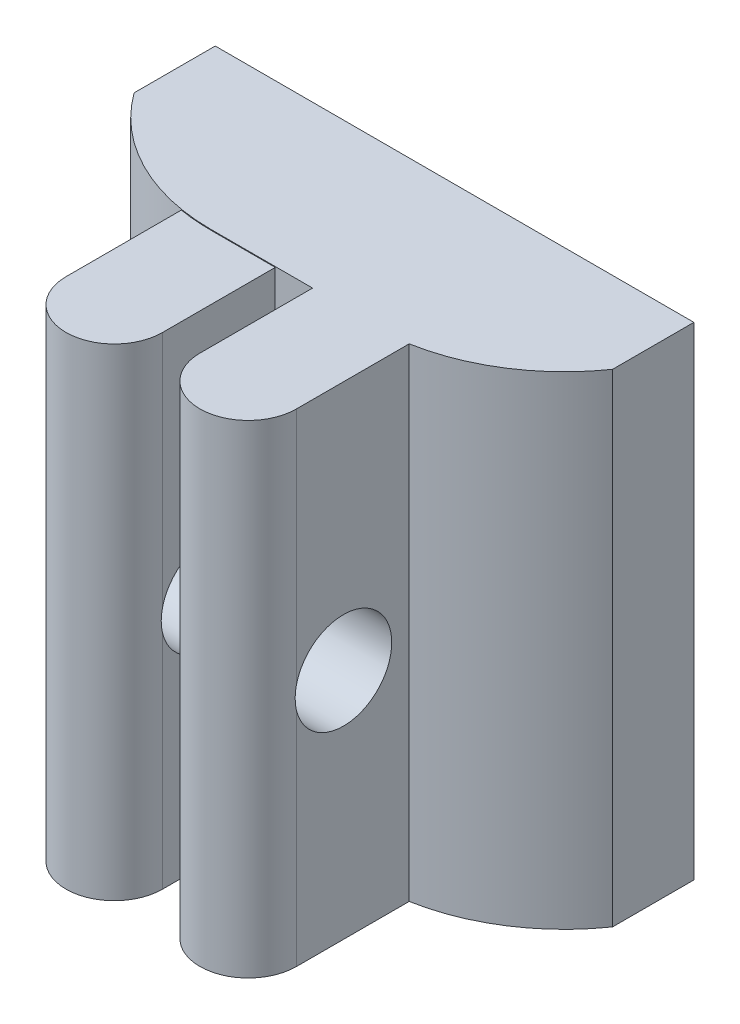
ISO-10303-21;
HEADER;
FILE_DESCRIPTION(('STEP AP214'),'2;1');
FILE_NAME('part.step','',(''),(''),'','','');
FILE_SCHEMA(('AUTOMOTIVE_DESIGN { 1 0 10303 214 1 1 1 1 }'));
ENDSEC;
DATA;
#1=APPLICATION_CONTEXT('core data for automotive mechanical design processes');
#2=APPLICATION_PROTOCOL_DEFINITION('international standard','automotive_design',2000,#1);
#3=PRODUCT_CONTEXT('',#1,'mechanical');
#4=PRODUCT('Part','Part','',(#3));
#5=PRODUCT_RELATED_PRODUCT_CATEGORY('part','',(#4));
#6=PRODUCT_DEFINITION_FORMATION('','',#4);
#7=PRODUCT_DEFINITION_CONTEXT('part definition',#1,'design');
#8=PRODUCT_DEFINITION('design','',#6,#7);
#9=PRODUCT_DEFINITION_SHAPE('','',#8);
#10=(LENGTH_UNIT() NAMED_UNIT(*) SI_UNIT(.MILLI.,.METRE.));
#11=(NAMED_UNIT(*) PLANE_ANGLE_UNIT() SI_UNIT($,.RADIAN.));
#12=(NAMED_UNIT(*) SI_UNIT($,.STERADIAN.) SOLID_ANGLE_UNIT());
#13=UNCERTAINTY_MEASURE_WITH_UNIT(LENGTH_MEASURE(1.E-05),#10,'distance_accuracy_value','');
#14=(GEOMETRIC_REPRESENTATION_CONTEXT(3) GLOBAL_UNCERTAINTY_ASSIGNED_CONTEXT((#13)) GLOBAL_UNIT_ASSIGNED_CONTEXT((#10,
#11,#12)) REPRESENTATION_CONTEXT('',''));
#15=CARTESIAN_POINT('',(0.,0.,0.));
#16=DIRECTION('',(0.,0.,1.));
#17=DIRECTION('',(1.,0.,0.));
#18=AXIS2_PLACEMENT_3D('',#15,#16,#17);
#19=CARTESIAN_POINT('',(0.,0.,5.));
#20=DIRECTION('',(0.,-1.,0.));
#21=DIRECTION('',(1.,0.,0.));
#22=AXIS2_PLACEMENT_3D('',#19,#20,#21);
#23=PLANE('',#22);
#24=DIRECTION('',(0.,0.,-1.));
#25=VECTOR('',#24,1.);
#26=CARTESIAN_POINT('',(-1.07615494269157,0.,10.));
#27=LINE('',#26,#25);
#28=CARTESIAN_POINT('',(-1.07615494269157,0.,2.52666623854685));
#29=VERTEX_POINT('',#28);
#30=CARTESIAN_POINT('',(-1.07615494269157,0.,0.));
#31=VERTEX_POINT('',#30);
#32=EDGE_CURVE('E56',#29,#31,#27,.T.);
#33=ORIENTED_EDGE('',*,*,#32,.T.);
#34=DIRECTION('',(-1.,0.,0.));
#35=VECTOR('',#34,1.);
#36=CARTESIAN_POINT('',(0.,0.,0.));
#37=LINE('',#36,#35);
#38=CARTESIAN_POINT('',(-15.9435867013809,0.,0.));
#39=VERTEX_POINT('',#38);
#40=EDGE_CURVE('E171',#31,#39,#37,.T.);
#41=ORIENTED_EDGE('',*,*,#40,.T.);
#42=DIRECTION('',(0.,0.,-1.));
#43=VECTOR('',#42,1.);
#44=CARTESIAN_POINT('',(-15.9435867013809,0.,10.));
#45=LINE('',#44,#43);
#46=CARTESIAN_POINT('',(-15.9435867013809,0.,2.51903987752583));
#47=VERTEX_POINT('',#46);
#48=EDGE_CURVE('E334',#47,#39,#45,.T.);
#49=ORIENTED_EDGE('',*,*,#48,.F.);
#50=CARTESIAN_POINT('',(-11.0839202169004,0.,-1.));
#51=DIRECTION('',(0.,-1.,0.));
#52=DIRECTION('',(1.,0.,0.));
#53=AXIS2_PLACEMENT_3D('',#50,#51,#52);
#54=CIRCLE('',#53,6.);
#55=CARTESIAN_POINT('',(-11.0839202169004,0.,5.));
#56=VERTEX_POINT('',#55);
#57=EDGE_CURVE('E192',#47,#56,#54,.F.);
#58=ORIENTED_EDGE('',*,*,#57,.T.);
#59=DIRECTION('',(-1.,0.,0.));
#60=VECTOR('',#59,1.);
#61=CARTESIAN_POINT('',(0.,0.,5.));
#62=LINE('',#61,#60);
#63=CARTESIAN_POINT('',(-7.92,0.,5.));
#64=VERTEX_POINT('',#63);
#65=EDGE_CURVE('E181',#64,#56,#62,.T.);
#66=ORIENTED_EDGE('',*,*,#65,.F.);
#67=DIRECTION('',(0.,0.,-1.));
#68=VECTOR('',#67,1.);
#69=CARTESIAN_POINT('',(-7.92,0.,10.));
#70=LINE('',#69,#68);
#71=CARTESIAN_POINT('',(-7.92,0.,8.5));
#72=VERTEX_POINT('',#71);
#73=EDGE_CURVE('E317',#72,#64,#70,.T.);
#74=ORIENTED_EDGE('',*,*,#73,.F.);
#75=CARTESIAN_POINT('',(-6.42,0.,8.5));
#76=DIRECTION('',(0.,-1.,0.));
#77=DIRECTION('',(1.,0.,0.));
#78=AXIS2_PLACEMENT_3D('',#75,#76,#77);
#79=CIRCLE('',#78,1.5);
#80=CARTESIAN_POINT('',(-4.92,0.,8.5));
#81=VERTEX_POINT('',#80);
#82=EDGE_CURVE('E271',#72,#81,#79,.F.);
#83=ORIENTED_EDGE('',*,*,#82,.T.);
#84=DIRECTION('',(0.,0.,-1.));
#85=VECTOR('',#84,1.);
#86=CARTESIAN_POINT('',(-4.92,0.,10.));
#87=LINE('',#86,#85);
#88=CARTESIAN_POINT('',(-4.92,0.,5.));
#89=VERTEX_POINT('',#88);
#90=EDGE_CURVE('E319',#81,#89,#87,.T.);
#91=ORIENTED_EDGE('',*,*,#90,.T.);
#92=CARTESIAN_POINT('',(-6.,0.,-0.90199966113181));
#93=DIRECTION('',(0.,-1.,0.));
#94=DIRECTION('',(1.,0.,0.));
#95=AXIS2_PLACEMENT_3D('',#92,#93,#94);
#96=CIRCLE('',#95,6.);
#97=EDGE_CURVE('E173',#89,#29,#96,.F.);
#98=ORIENTED_EDGE('',*,*,#97,.T.);
#99=EDGE_LOOP('',(#33,#41,#49,#58,#66,#74,#83,#91,#98));
#100=FACE_BOUND('',#99,.T.);
#101=ADVANCED_FACE('F39',(#100),#23,.F.);
#102=CARTESIAN_POINT('',(0.,-15.,5.));
#103=DIRECTION('',(0.,1.,0.));
#104=DIRECTION('',(-1.,0.,0.));
#105=AXIS2_PLACEMENT_3D('',#102,#103,#104);
#106=PLANE('',#105);
#107=DIRECTION('',(0.,0.,-1.));
#108=VECTOR('',#107,1.);
#109=CARTESIAN_POINT('',(-1.07615494269157,-15.,10.));
#110=LINE('',#109,#108);
#111=CARTESIAN_POINT('',(-1.07615494269157,-15.,2.52666623854686));
#112=VERTEX_POINT('',#111);
#113=CARTESIAN_POINT('',(-1.07615494269157,-15.,0.));
#114=VERTEX_POINT('',#113);
#115=EDGE_CURVE('E160',#112,#114,#110,.T.);
#116=ORIENTED_EDGE('',*,*,#115,.F.);
#117=CARTESIAN_POINT('',(-6.,-15.,-0.90199966113181));
#118=DIRECTION('',(0.,1.,0.));
#119=DIRECTION('',(-1.,0.,0.));
#120=AXIS2_PLACEMENT_3D('',#117,#118,#119);
#121=CIRCLE('',#120,6.);
#122=CARTESIAN_POINT('',(-4.92,-15.,5.));
#123=VERTEX_POINT('',#122);
#124=EDGE_CURVE('E198',#112,#123,#121,.F.);
#125=ORIENTED_EDGE('',*,*,#124,.T.);
#126=DIRECTION('',(0.,0.,-1.));
#127=VECTOR('',#126,1.);
#128=CARTESIAN_POINT('',(-4.92,-15.,10.));
#129=LINE('',#128,#127);
#130=CARTESIAN_POINT('',(-4.92,-15.,8.5));
#131=VERTEX_POINT('',#130);
#132=EDGE_CURVE('E183',#131,#123,#129,.T.);
#133=ORIENTED_EDGE('',*,*,#132,.F.);
#134=CARTESIAN_POINT('',(-6.42,-15.,8.5));
#135=DIRECTION('',(0.,1.,0.));
#136=DIRECTION('',(-1.,0.,0.));
#137=AXIS2_PLACEMENT_3D('',#134,#135,#136);
#138=CIRCLE('',#137,1.5);
#139=CARTESIAN_POINT('',(-7.92,-15.,8.5));
#140=VERTEX_POINT('',#139);
#141=EDGE_CURVE('E269',#131,#140,#138,.F.);
#142=ORIENTED_EDGE('',*,*,#141,.T.);
#143=DIRECTION('',(0.,0.,-1.));
#144=VECTOR('',#143,1.);
#145=CARTESIAN_POINT('',(-7.92,-15.,10.));
#146=LINE('',#145,#144);
#147=CARTESIAN_POINT('',(-7.92,-15.,5.));
#148=VERTEX_POINT('',#147);
#149=EDGE_CURVE('E179',#140,#148,#146,.T.);
#150=ORIENTED_EDGE('',*,*,#149,.T.);
#151=DIRECTION('',(1.,0.,0.));
#152=VECTOR('',#151,1.);
#153=CARTESIAN_POINT('',(0.,-15.,5.));
#154=LINE('',#153,#152);
#155=CARTESIAN_POINT('',(-9.08,-15.,5.));
#156=VERTEX_POINT('',#155);
#157=EDGE_CURVE('E186',#156,#148,#154,.T.);
#158=ORIENTED_EDGE('',*,*,#157,.F.);
#159=DIRECTION('',(0.,0.,-1.));
#160=VECTOR('',#159,1.);
#161=CARTESIAN_POINT('',(-9.08,-15.,10.));
#162=LINE('',#161,#160);
#163=CARTESIAN_POINT('',(-9.08,-15.,8.5));
#164=VERTEX_POINT('',#163);
#165=EDGE_CURVE('E286',#164,#156,#162,.T.);
#166=ORIENTED_EDGE('',*,*,#165,.F.);
#167=CARTESIAN_POINT('',(-10.58,-15.,8.5));
#168=DIRECTION('',(0.,1.,0.));
#169=DIRECTION('',(-1.,0.,0.));
#170=AXIS2_PLACEMENT_3D('',#167,#168,#169);
#171=CIRCLE('',#170,1.5);
#172=CARTESIAN_POINT('',(-12.08,-15.,8.5));
#173=VERTEX_POINT('',#172);
#174=EDGE_CURVE('E283',#164,#173,#171,.F.);
#175=ORIENTED_EDGE('',*,*,#174,.T.);
#176=DIRECTION('',(0.,0.,-1.));
#177=VECTOR('',#176,1.);
#178=CARTESIAN_POINT('',(-12.08,-15.,10.));
#179=LINE('',#178,#177);
#180=CARTESIAN_POINT('',(-12.08,-15.,4.91674108489633));
#181=VERTEX_POINT('',#180);
#182=EDGE_CURVE('E281',#173,#181,#179,.T.);
#183=ORIENTED_EDGE('',*,*,#182,.T.);
#184=CARTESIAN_POINT('',(-11.0839202169004,-15.,-1.));
#185=DIRECTION('',(0.,1.,0.));
#186=DIRECTION('',(-1.,0.,0.));
#187=AXIS2_PLACEMENT_3D('',#184,#185,#186);
#188=CIRCLE('',#187,6.);
#189=CARTESIAN_POINT('',(-15.9435867013809,-15.,2.51903987752583));
#190=VERTEX_POINT('',#189);
#191=EDGE_CURVE('E195',#181,#190,#188,.F.);
#192=ORIENTED_EDGE('',*,*,#191,.T.);
#193=DIRECTION('',(0.,0.,-1.));
#194=VECTOR('',#193,1.);
#195=CARTESIAN_POINT('',(-15.9435867013809,-15.,10.));
#196=LINE('',#195,#194);
#197=CARTESIAN_POINT('',(-15.9435867013809,-15.,0.));
#198=VERTEX_POINT('',#197);
#199=EDGE_CURVE('E63',#190,#198,#196,.T.);
#200=ORIENTED_EDGE('',*,*,#199,.T.);
#201=DIRECTION('',(1.,0.,0.));
#202=VECTOR('',#201,1.);
#203=CARTESIAN_POINT('',(0.,-15.,0.));
#204=LINE('',#203,#202);
#205=EDGE_CURVE('E178',#198,#114,#204,.T.);
#206=ORIENTED_EDGE('',*,*,#205,.T.);
#207=EDGE_LOOP('',(#116,#125,#133,#142,#150,#158,#166,#175,#183,#192,#200,#206));
#208=FACE_BOUND('',#207,.T.);
#209=ADVANCED_FACE('F279',(#208),#106,.F.);
#210=CARTESIAN_POINT('',(0.,0.,0.));
#211=DIRECTION('',(0.,0.,-1.));
#212=DIRECTION('',(-1.,0.,0.));
#213=AXIS2_PLACEMENT_3D('',#210,#211,#212);
#214=PLANE('',#213);
#215=ORIENTED_EDGE('',*,*,#40,.F.);
#216=DIRECTION('',(0.,-1.,0.));
#217=VECTOR('',#216,1.);
#218=CARTESIAN_POINT('',(-1.07615494269157,0.,0.));
#219=LINE('',#218,#217);
#220=EDGE_CURVE('E157',#31,#114,#219,.T.);
#221=ORIENTED_EDGE('',*,*,#220,.T.);
#222=ORIENTED_EDGE('',*,*,#205,.F.);
#223=DIRECTION('',(0.,1.,0.));
#224=VECTOR('',#223,1.);
#225=CARTESIAN_POINT('',(-15.9435867013809,0.,0.));
#226=LINE('',#225,#224);
#227=EDGE_CURVE('E165',#198,#39,#226,.T.);
#228=ORIENTED_EDGE('',*,*,#227,.T.);
#229=EDGE_LOOP('',(#215,#221,#222,#228));
#230=FACE_BOUND('',#229,.T.);
#231=ADVANCED_FACE('F177',(#230),#214,.T.);
#232=CARTESIAN_POINT('',(-6.,0.,-0.90199966113181));
#233=DIRECTION('',(0.,1.,0.));
#234=DIRECTION('',(-1.,0.,0.));
#235=AXIS2_PLACEMENT_3D('',#232,#233,#234);
#236=CYLINDRICAL_SURFACE('',#235,6.);
#237=ORIENTED_EDGE('',*,*,#124,.F.);
#238=DIRECTION('',(0.,1.,0.));
#239=VECTOR('',#238,1.);
#240=CARTESIAN_POINT('',(-1.07615494269157,0.,2.52666623854686));
#241=LINE('',#240,#239);
#242=EDGE_CURVE('E11',#112,#29,#241,.T.);
#243=ORIENTED_EDGE('',*,*,#242,.T.);
#244=ORIENTED_EDGE('',*,*,#97,.F.);
#245=DIRECTION('',(0.,1.,0.));
#246=VECTOR('',#245,1.);
#247=CARTESIAN_POINT('',(-4.92,0.,5.));
#248=LINE('',#247,#246);
#249=EDGE_CURVE('E314',#123,#89,#248,.T.);
#250=ORIENTED_EDGE('',*,*,#249,.F.);
#251=EDGE_LOOP('',(#237,#243,#244,#250));
#252=FACE_BOUND('',#251,.T.);
#253=ADVANCED_FACE('F369',(#252),#236,.T.);
#254=CARTESIAN_POINT('',(-11.0839202169004,0.,-1.));
#255=DIRECTION('',(0.,1.,0.));
#256=DIRECTION('',(0.,0.,1.));
#257=AXIS2_PLACEMENT_3D('',#254,#255,#256);
#258=CYLINDRICAL_SURFACE('',#257,6.);
#259=ORIENTED_EDGE('',*,*,#57,.F.);
#260=DIRECTION('',(0.,1.,0.));
#261=VECTOR('',#260,1.);
#262=CARTESIAN_POINT('',(-15.9435867013809,0.,2.51903987752583));
#263=LINE('',#262,#261);
#264=EDGE_CURVE('E49',#47,#190,#263,.F.);
#265=ORIENTED_EDGE('',*,*,#264,.T.);
#266=ORIENTED_EDGE('',*,*,#191,.F.);
#267=DIRECTION('',(0.,1.,0.));
#268=VECTOR('',#267,1.);
#269=CARTESIAN_POINT('',(-12.08,-0.0236385703848998,4.91674108489633));
#270=LINE('',#269,#268);
#271=CARTESIAN_POINT('',(-12.08,-0.0236385703848998,4.91674108489633));
#272=VERTEX_POINT('',#271);
#273=EDGE_CURVE('E206',#272,#181,#270,.F.);
#274=ORIENTED_EDGE('',*,*,#273,.F.);
#275=CARTESIAN_POINT('',(-11.0839202169004,-0.0236385703848998,-1.));
#276=DIRECTION('',(0.,-1.,0.));
#277=DIRECTION('',(1.,0.,0.));
#278=AXIS2_PLACEMENT_3D('',#275,#276,#277);
#279=CIRCLE('',#278,6.);
#280=CARTESIAN_POINT('',(-11.0839202169004,-0.0236385703848998,5.));
#281=VERTEX_POINT('',#280);
#282=EDGE_CURVE('E203',#281,#272,#279,.T.);
#283=ORIENTED_EDGE('',*,*,#282,.F.);
#284=DIRECTION('',(0.,1.,0.));
#285=VECTOR('',#284,1.);
#286=CARTESIAN_POINT('',(-11.0839202169004,0.,5.));
#287=LINE('',#286,#285);
#288=EDGE_CURVE('E200',#56,#281,#287,.F.);
#289=ORIENTED_EDGE('',*,*,#288,.F.);
#290=EDGE_LOOP('',(#259,#265,#266,#274,#283,#289));
#291=FACE_BOUND('',#290,.T.);
#292=ADVANCED_FACE('F275',(#291),#258,.T.);
#293=CARTESIAN_POINT('',(-6.42,-15.,8.5));
#294=DIRECTION('',(0.,-1.,0.));
#295=DIRECTION('',(1.,0.,0.));
#296=AXIS2_PLACEMENT_3D('',#293,#294,#295);
#297=CYLINDRICAL_SURFACE('',#296,1.5);
#298=DIRECTION('',(0.,1.,0.));
#299=VECTOR('',#298,1.);
#300=CARTESIAN_POINT('',(-7.92,-15.,8.5));
#301=LINE('',#300,#299);
#302=CARTESIAN_POINT('',(-7.92,-8.11241498930769,8.5));
#303=VERTEX_POINT('',#302);
#304=EDGE_CURVE('E257',#140,#303,#301,.T.);
#305=ORIENTED_EDGE('',*,*,#304,.F.);
#306=ORIENTED_EDGE('',*,*,#141,.F.);
#307=DIRECTION('',(0.,1.,0.));
#308=VECTOR('',#307,1.);
#309=CARTESIAN_POINT('',(-4.92,-15.,8.5));
#310=LINE('',#309,#308);
#311=CARTESIAN_POINT('',(-4.92,-8.11241498930769,8.5));
#312=VERTEX_POINT('',#311);
#313=EDGE_CURVE('E264',#312,#131,#310,.F.);
#314=ORIENTED_EDGE('',*,*,#313,.F.);
#315=CARTESIAN_POINT('',(-4.92,-7.41254560298488,8.5));
#316=CARTESIAN_POINT('',(-4.92001371546828,-7.45412724418204,8.50998083315785));
#317=CARTESIAN_POINT('',(-4.9201002060891,-7.49613741775952,8.51817415680516));
#318=CARTESIAN_POINT('',(-4.9203019560262,-7.58070019302562,8.53094623275822));
#319=CARTESIAN_POINT('',(-4.92041721297341,-7.6232527497722,8.53552528259058));
#320=CARTESIAN_POINT('',(-4.92055778771822,-7.70741499094998,8.54095494207867));
#321=CARTESIAN_POINT('',(-4.92058549988733,-7.74901828635982,8.54190496227109));
#322=CARTESIAN_POINT('',(-4.92054226277862,-7.83215876470274,8.54034650872186));
#323=CARTESIAN_POINT('',(-4.9204713169154,-7.8736959498741,8.53783815467585));
#324=CARTESIAN_POINT('',(-4.92028181879158,-7.95642005855864,8.52937975231243));
#325=CARTESIAN_POINT('',(-4.92016326453282,-7.99760696729637,8.52342955953406));
#326=CARTESIAN_POINT('',(-4.92000273049526,-8.07934507147401,8.50812900417141));
#327=CARTESIAN_POINT('',(-4.91996075234869,-8.11989625334496,8.49877856911518));
#328=CARTESIAN_POINT('',(-4.92014167531044,-8.20122206947848,8.47642670475488));
#329=CARTESIAN_POINT('',(-4.92037213747244,-8.24197030682407,8.46332907491474));
#330=CARTESIAN_POINT('',(-4.9213953460393,-8.322200778971,8.43370599562309));
#331=CARTESIAN_POINT('',(-4.92218818592813,-8.36168280214909,8.4171799765941));
#332=CARTESIAN_POINT('',(-4.92340465615959,-8.40037620756465,8.39899318441214));
#333=B_SPLINE_CURVE_WITH_KNOTS('',3,(#315,#316,#317,#318,#319,#320,#321,#322,#323,#324,#325,
#326,#327,#328,#329,#330,#331,#332),.UNSPECIFIED.,.F.,.F.,(4,2,2,2,2,2,2,2,4),(0.,
0.128248812008016,0.256487065486652,0.381186174696836,0.505880968132207,0.630580995641019,
0.755283681131896,0.883530080847569,1.01179780394237),.UNSPECIFIED.);
#334=CARTESIAN_POINT('',(-4.92,-7.41254560298488,8.5));
#335=VERTEX_POINT('',#334);
#336=EDGE_CURVE('E249',#335,#312,#333,.T.);
#337=ORIENTED_EDGE('',*,*,#336,.F.);
#338=DIRECTION('',(0.,1.,0.));
#339=VECTOR('',#338,1.);
#340=CARTESIAN_POINT('',(-4.92,-15.,8.5));
#341=LINE('',#340,#339);
#342=EDGE_CURVE('E267',#81,#335,#341,.F.);
#343=ORIENTED_EDGE('',*,*,#342,.F.);
#344=ORIENTED_EDGE('',*,*,#82,.F.);
#345=DIRECTION('',(0.,1.,0.));
#346=VECTOR('',#345,1.);
#347=CARTESIAN_POINT('',(-7.92,-15.,8.5));
#348=LINE('',#347,#346);
#349=CARTESIAN_POINT('',(-7.92,-7.41254560298488,8.5));
#350=VERTEX_POINT('',#349);
#351=EDGE_CURVE('E332',#350,#72,#348,.T.);
#352=ORIENTED_EDGE('',*,*,#351,.F.);
#353=CARTESIAN_POINT('',(-7.92,-8.11241498930769,8.5));
#354=CARTESIAN_POINT('',(-7.91998628453172,-8.07083334811054,8.50998083315785));
#355=CARTESIAN_POINT('',(-7.9198997939109,-8.02882317453306,8.51817415680516));
#356=CARTESIAN_POINT('',(-7.9196980439738,-7.94426039926696,8.53094623275822));
#357=CARTESIAN_POINT('',(-7.91958278702659,-7.90170784252037,8.53552528259058));
#358=CARTESIAN_POINT('',(-7.91944221228178,-7.8175456013426,8.54095494207867));
#359=CARTESIAN_POINT('',(-7.91941450011267,-7.77594230593276,8.54190496227109));
#360=CARTESIAN_POINT('',(-7.91945773722137,-7.69280182758984,8.54034650872186));
#361=CARTESIAN_POINT('',(-7.9195286830846,-7.65126464241848,8.53783815467585));
#362=CARTESIAN_POINT('',(-7.91971818120842,-7.56854053373394,8.52937975231243));
#363=CARTESIAN_POINT('',(-7.91983673546718,-7.52735362499621,8.52342955953406));
#364=CARTESIAN_POINT('',(-7.91999726950474,-7.44561552081858,8.50812900417141));
#365=CARTESIAN_POINT('',(-7.92003924765131,-7.40506433894762,8.49877856911519));
#366=CARTESIAN_POINT('',(-7.91985832468956,-7.3237385228141,8.47642670475488));
#367=CARTESIAN_POINT('',(-7.91962786252755,-7.28299028546851,8.46332907491475));
#368=CARTESIAN_POINT('',(-7.9186046539607,-7.20275981332158,8.4337059956231));
#369=CARTESIAN_POINT('',(-7.91781181407187,-7.16327779014349,8.41717997659411));
#370=CARTESIAN_POINT('',(-7.91659534384041,-7.12458438472793,8.39899318441214));
#371=B_SPLINE_CURVE_WITH_KNOTS('',3,(#353,#354,#355,#356,#357,#358,#359,#360,#361,#362,#363,
#364,#365,#366,#367,#368,#369,#370),.UNSPECIFIED.,.F.,.F.,(4,2,2,2,2,2,2,2,4),(0.,
0.128248812008016,0.25648706548665,0.381186174696835,0.505880968132204,0.630580995641014,
0.755283681131891,0.883530080847564,1.01179780394237),.UNSPECIFIED.);
#372=EDGE_CURVE('E256',#303,#350,#371,.T.);
#373=ORIENTED_EDGE('',*,*,#372,.F.);
#374=EDGE_LOOP('',(#305,#306,#314,#337,#343,#344,#352,#373));
#375=FACE_BOUND('',#374,.T.);
#376=ADVANCED_FACE('F42',(#375),#297,.T.);
#377=CARTESIAN_POINT('',(-10.58,-15.,8.5));
#378=DIRECTION('',(0.,-1.,0.));
#379=DIRECTION('',(1.,0.,0.));
#380=AXIS2_PLACEMENT_3D('',#377,#378,#379);
#381=CYLINDRICAL_SURFACE('',#380,1.5);
#382=DIRECTION('',(0.,1.,0.));
#383=VECTOR('',#382,1.);
#384=CARTESIAN_POINT('',(-12.08,-15.,8.5));
#385=LINE('',#384,#383);
#386=CARTESIAN_POINT('',(-12.08,-8.11241498930769,8.5));
#387=VERTEX_POINT('',#386);
#388=EDGE_CURVE('E212',#173,#387,#385,.T.);
#389=ORIENTED_EDGE('',*,*,#388,.F.);
#390=ORIENTED_EDGE('',*,*,#174,.F.);
#391=DIRECTION('',(0.,1.,0.));
#392=VECTOR('',#391,1.);
#393=CARTESIAN_POINT('',(-9.08,-15.,8.5));
#394=LINE('',#393,#392);
#395=CARTESIAN_POINT('',(-9.08,-8.11241498930769,8.5));
#396=VERTEX_POINT('',#395);
#397=EDGE_CURVE('E348',#396,#164,#394,.F.);
#398=ORIENTED_EDGE('',*,*,#397,.F.);
#399=CARTESIAN_POINT('',(-9.08,-7.41254560298488,8.5));
#400=CARTESIAN_POINT('',(-9.08001371546828,-7.45412724418204,8.50998083315785));
#401=CARTESIAN_POINT('',(-9.0801002060891,-7.49613741775952,8.51817415680516));
#402=CARTESIAN_POINT('',(-9.0803019560262,-7.58070019302562,8.53094623275822));
#403=CARTESIAN_POINT('',(-9.08041721297341,-7.6232527497722,8.53552528259058));
#404=CARTESIAN_POINT('',(-9.08055778771822,-7.70741499094998,8.54095494207867));
#405=CARTESIAN_POINT('',(-9.08058549988733,-7.74901828635982,8.54190496227109));
#406=CARTESIAN_POINT('',(-9.08054226277862,-7.83215876470274,8.54034650872186));
#407=CARTESIAN_POINT('',(-9.0804713169154,-7.8736959498741,8.53783815467585));
#408=CARTESIAN_POINT('',(-9.08028181879158,-7.95642005855864,8.52937975231243));
#409=CARTESIAN_POINT('',(-9.08016326453282,-7.99760696729637,8.52342955953406));
#410=CARTESIAN_POINT('',(-9.08000273049526,-8.07934507147401,8.50812900417141));
#411=CARTESIAN_POINT('',(-9.07996075234869,-8.11989625334496,8.49877856911518));
#412=CARTESIAN_POINT('',(-9.08014167531044,-8.20122206947848,8.47642670475488));
#413=CARTESIAN_POINT('',(-9.08037213747244,-8.24197030682407,8.46332907491474));
#414=CARTESIAN_POINT('',(-9.0813953460393,-8.322200778971,8.43370599562309));
#415=CARTESIAN_POINT('',(-9.08218818592813,-8.36168280214909,8.4171799765941));
#416=CARTESIAN_POINT('',(-9.08340465615959,-8.40037620756465,8.39899318441214));
#417=B_SPLINE_CURVE_WITH_KNOTS('',3,(#399,#400,#401,#402,#403,#404,#405,#406,#407,#408,#409,
#410,#411,#412,#413,#414,#415,#416),.UNSPECIFIED.,.F.,.F.,(4,2,2,2,2,2,2,2,4),(0.,
0.128248812008016,0.256487065486652,0.381186174696836,0.505880968132207,0.630580995641019,
0.755283681131896,0.883530080847569,1.01179780394237),.UNSPECIFIED.);
#418=CARTESIAN_POINT('',(-9.08,-7.41254560298488,8.5));
#419=VERTEX_POINT('',#418);
#420=EDGE_CURVE('E215',#419,#396,#417,.T.);
#421=ORIENTED_EDGE('',*,*,#420,.F.);
#422=DIRECTION('',(0.,1.,0.));
#423=VECTOR('',#422,1.);
#424=CARTESIAN_POINT('',(-9.08,-15.,8.5));
#425=LINE('',#424,#423);
#426=CARTESIAN_POINT('',(-9.08,-0.0236385703848998,8.5));
#427=VERTEX_POINT('',#426);
#428=EDGE_CURVE('E352',#427,#419,#425,.F.);
#429=ORIENTED_EDGE('',*,*,#428,.F.);
#430=CARTESIAN_POINT('',(-10.58,-0.0236385703849002,8.5));
#431=DIRECTION('',(0.,-1.,0.));
#432=DIRECTION('',(1.,0.,0.));
#433=AXIS2_PLACEMENT_3D('',#430,#431,#432);
#434=CIRCLE('',#433,1.5);
#435=CARTESIAN_POINT('',(-12.08,-0.0236385703848998,8.5));
#436=VERTEX_POINT('',#435);
#437=EDGE_CURVE('E356',#436,#427,#434,.F.);
#438=ORIENTED_EDGE('',*,*,#437,.F.);
#439=DIRECTION('',(0.,1.,0.));
#440=VECTOR('',#439,1.);
#441=CARTESIAN_POINT('',(-12.08,-15.,8.5));
#442=LINE('',#441,#440);
#443=CARTESIAN_POINT('',(-12.08,-7.41254560298488,8.5));
#444=VERTEX_POINT('',#443);
#445=EDGE_CURVE('E209',#444,#436,#442,.T.);
#446=ORIENTED_EDGE('',*,*,#445,.F.);
#447=CARTESIAN_POINT('',(-12.08,-8.11241498930769,8.5));
#448=CARTESIAN_POINT('',(-12.0799862845317,-8.07083334811054,8.50998083315785));
#449=CARTESIAN_POINT('',(-12.0798997939109,-8.02882317453306,8.51817415680516));
#450=CARTESIAN_POINT('',(-12.0796980439738,-7.94426039926696,8.53094623275822));
#451=CARTESIAN_POINT('',(-12.0795827870266,-7.90170784252037,8.53552528259058));
#452=CARTESIAN_POINT('',(-12.0794422122818,-7.8175456013426,8.54095494207867));
#453=CARTESIAN_POINT('',(-12.0794145001127,-7.77594230593276,8.54190496227109));
#454=CARTESIAN_POINT('',(-12.0794577372214,-7.69280182758984,8.54034650872186));
#455=CARTESIAN_POINT('',(-12.0795286830846,-7.65126464241848,8.53783815467585));
#456=CARTESIAN_POINT('',(-12.0797181812084,-7.56854053373394,8.52937975231243));
#457=CARTESIAN_POINT('',(-12.0798367354672,-7.52735362499621,8.52342955953406));
#458=CARTESIAN_POINT('',(-12.0799972695047,-7.44561552081858,8.50812900417141));
#459=CARTESIAN_POINT('',(-12.0800392476513,-7.40506433894762,8.49877856911519));
#460=CARTESIAN_POINT('',(-12.0798583246896,-7.3237385228141,8.47642670475488));
#461=CARTESIAN_POINT('',(-12.0796278625276,-7.28299028546851,8.46332907491475));
#462=CARTESIAN_POINT('',(-12.0786046539607,-7.20275981332158,8.4337059956231));
#463=CARTESIAN_POINT('',(-12.0778118140719,-7.16327779014349,8.41717997659411));
#464=CARTESIAN_POINT('',(-12.0765953438404,-7.12458438472793,8.39899318441214));
#465=B_SPLINE_CURVE_WITH_KNOTS('',3,(#447,#448,#449,#450,#451,#452,#453,#454,#455,#456,#457,
#458,#459,#460,#461,#462,#463,#464),.UNSPECIFIED.,.F.,.F.,(4,2,2,2,2,2,2,2,4),(0.,
0.128248812008016,0.25648706548665,0.381186174696835,0.505880968132204,0.630580995641014,
0.755283681131891,0.883530080847564,1.01179780394237),.UNSPECIFIED.);
#466=EDGE_CURVE('E223',#387,#444,#465,.T.);
#467=ORIENTED_EDGE('',*,*,#466,.F.);
#468=EDGE_LOOP('',(#389,#390,#398,#421,#429,#438,#446,#467));
#469=FACE_BOUND('',#468,.T.);
#470=ADVANCED_FACE('F230',(#469),#381,.T.);
#471=CARTESIAN_POINT('',(0.,0.,5.));
#472=DIRECTION('',(0.,0.,-1.));
#473=DIRECTION('',(-1.,0.,0.));
#474=AXIS2_PLACEMENT_3D('',#471,#472,#473);
#475=PLANE('',#474);
#476=ORIENTED_EDGE('',*,*,#65,.T.);
#477=ORIENTED_EDGE('',*,*,#288,.T.);
#478=DIRECTION('',(-1.,0.,0.));
#479=VECTOR('',#478,1.);
#480=CARTESIAN_POINT('',(-12.08,-0.0236385703848998,5.));
#481=LINE('',#480,#479);
#482=CARTESIAN_POINT('',(-9.08,-0.0236385703848998,5.));
#483=VERTEX_POINT('',#482);
#484=EDGE_CURVE('E298',#483,#281,#481,.T.);
#485=ORIENTED_EDGE('',*,*,#484,.F.);
#486=DIRECTION('',(0.,1.,0.));
#487=VECTOR('',#486,1.);
#488=CARTESIAN_POINT('',(-9.08,-0.0236385703848998,5.));
#489=LINE('',#488,#487);
#490=EDGE_CURVE('E305',#156,#483,#489,.T.);
#491=ORIENTED_EDGE('',*,*,#490,.F.);
#492=ORIENTED_EDGE('',*,*,#157,.T.);
#493=DIRECTION('',(0.,-1.,0.));
#494=VECTOR('',#493,1.);
#495=CARTESIAN_POINT('',(-7.92,0.,5.));
#496=LINE('',#495,#494);
#497=EDGE_CURVE('E307',#64,#148,#496,.T.);
#498=ORIENTED_EDGE('',*,*,#497,.F.);
#499=EDGE_LOOP('',(#476,#477,#485,#491,#492,#498));
#500=FACE_BOUND('',#499,.T.);
#501=ADVANCED_FACE('F296',(#500),#475,.F.);
#502=CARTESIAN_POINT('',(-7.92,0.,10.));
#503=DIRECTION('',(1.,0.,0.));
#504=DIRECTION('',(0.,1.,0.));
#505=AXIS2_PLACEMENT_3D('',#502,#503,#504);
#506=PLANE('',#505);
#507=ORIENTED_EDGE('',*,*,#149,.F.);
#508=ORIENTED_EDGE('',*,*,#304,.T.);
#509=CARTESIAN_POINT('',(-7.92,-7.76248029614629,7.04138911613754));
#510=DIRECTION('',(1.,0.,0.));
#511=DIRECTION('',(0.,1.,0.));
#512=AXIS2_PLACEMENT_3D('',#509,#510,#511);
#513=CIRCLE('',#512,1.5);
#514=EDGE_CURVE('E287',#303,#350,#513,.T.);
#515=ORIENTED_EDGE('',*,*,#514,.T.);
#516=ORIENTED_EDGE('',*,*,#351,.T.);
#517=ORIENTED_EDGE('',*,*,#73,.T.);
#518=ORIENTED_EDGE('',*,*,#497,.T.);
#519=EDGE_LOOP('',(#507,#508,#515,#516,#517,#518));
#520=FACE_BOUND('',#519,.T.);
#521=ADVANCED_FACE('F326',(#520),#506,.F.);
#522=CARTESIAN_POINT('',(-4.92,0.,10.));
#523=DIRECTION('',(-1.,0.,0.));
#524=DIRECTION('',(0.,-1.,0.));
#525=AXIS2_PLACEMENT_3D('',#522,#523,#524);
#526=PLANE('',#525);
#527=ORIENTED_EDGE('',*,*,#90,.F.);
#528=ORIENTED_EDGE('',*,*,#342,.T.);
#529=CARTESIAN_POINT('',(-4.92,-7.76248029614629,7.04138911613754));
#530=DIRECTION('',(-1.,0.,0.));
#531=DIRECTION('',(0.,-1.,0.));
#532=AXIS2_PLACEMENT_3D('',#529,#530,#531);
#533=CIRCLE('',#532,1.5);
#534=EDGE_CURVE('E341',#335,#312,#533,.T.);
#535=ORIENTED_EDGE('',*,*,#534,.T.);
#536=ORIENTED_EDGE('',*,*,#313,.T.);
#537=ORIENTED_EDGE('',*,*,#132,.T.);
#538=ORIENTED_EDGE('',*,*,#249,.T.);
#539=EDGE_LOOP('',(#527,#528,#535,#536,#537,#538));
#540=FACE_BOUND('',#539,.T.);
#541=ADVANCED_FACE('F365',(#540),#526,.F.);
#542=CARTESIAN_POINT('',(-12.08,-0.0236385703848998,10.));
#543=DIRECTION('',(1.,0.,0.));
#544=DIRECTION('',(0.,1.,0.));
#545=AXIS2_PLACEMENT_3D('',#542,#543,#544);
#546=PLANE('',#545);
#547=ORIENTED_EDGE('',*,*,#182,.F.);
#548=ORIENTED_EDGE('',*,*,#388,.T.);
#549=CARTESIAN_POINT('',(-12.08,-7.76248029614629,7.04138911613754));
#550=DIRECTION('',(1.,0.,0.));
#551=DIRECTION('',(0.,1.,0.));
#552=AXIS2_PLACEMENT_3D('',#549,#550,#551);
#553=CIRCLE('',#552,1.5);
#554=EDGE_CURVE('E191',#387,#444,#553,.T.);
#555=ORIENTED_EDGE('',*,*,#554,.T.);
#556=ORIENTED_EDGE('',*,*,#445,.T.);
#557=DIRECTION('',(0.,0.,-1.));
#558=VECTOR('',#557,1.);
#559=CARTESIAN_POINT('',(-12.08,-0.0236385703848998,10.));
#560=LINE('',#559,#558);
#561=EDGE_CURVE('E290',#436,#272,#560,.T.);
#562=ORIENTED_EDGE('',*,*,#561,.T.);
#563=ORIENTED_EDGE('',*,*,#273,.T.);
#564=EDGE_LOOP('',(#547,#548,#555,#556,#562,#563));
#565=FACE_BOUND('',#564,.T.);
#566=ADVANCED_FACE('F242',(#565),#546,.F.);
#567=CARTESIAN_POINT('',(-9.08,-0.0236385703848998,10.));
#568=DIRECTION('',(-1.,0.,0.));
#569=DIRECTION('',(0.,-1.,0.));
#570=AXIS2_PLACEMENT_3D('',#567,#568,#569);
#571=PLANE('',#570);
#572=DIRECTION('',(0.,0.,-1.));
#573=VECTOR('',#572,1.);
#574=CARTESIAN_POINT('',(-9.08,-0.0236385703848998,10.));
#575=LINE('',#574,#573);
#576=EDGE_CURVE('E304',#427,#483,#575,.T.);
#577=ORIENTED_EDGE('',*,*,#576,.F.);
#578=ORIENTED_EDGE('',*,*,#428,.T.);
#579=CARTESIAN_POINT('',(-9.08,-7.76248029614629,7.04138911613754));
#580=DIRECTION('',(-1.,0.,0.));
#581=DIRECTION('',(0.,-1.,0.));
#582=AXIS2_PLACEMENT_3D('',#579,#580,#581);
#583=CIRCLE('',#582,1.5);
#584=EDGE_CURVE('E174',#419,#396,#583,.T.);
#585=ORIENTED_EDGE('',*,*,#584,.T.);
#586=ORIENTED_EDGE('',*,*,#397,.T.);
#587=ORIENTED_EDGE('',*,*,#165,.T.);
#588=ORIENTED_EDGE('',*,*,#490,.T.);
#589=EDGE_LOOP('',(#577,#578,#585,#586,#587,#588));
#590=FACE_BOUND('',#589,.T.);
#591=ADVANCED_FACE('F347',(#590),#571,.F.);
#592=CARTESIAN_POINT('',(-12.08,-0.0236385703848998,10.));
#593=DIRECTION('',(0.,-1.,0.));
#594=DIRECTION('',(1.,0.,0.));
#595=AXIS2_PLACEMENT_3D('',#592,#593,#594);
#596=PLANE('',#595);
#597=ORIENTED_EDGE('',*,*,#561,.F.);
#598=ORIENTED_EDGE('',*,*,#437,.T.);
#599=ORIENTED_EDGE('',*,*,#576,.T.);
#600=ORIENTED_EDGE('',*,*,#484,.T.);
#601=ORIENTED_EDGE('',*,*,#282,.T.);
#602=EDGE_LOOP('',(#597,#598,#599,#600,#601));
#603=FACE_BOUND('',#602,.T.);
#604=ADVANCED_FACE('F302',(#603),#596,.F.);
#605=CARTESIAN_POINT('',(-17.,-7.76248029614629,7.04138911613754));
#606=DIRECTION('',(1.,0.,0.));
#607=DIRECTION('',(0.,0.,-1.));
#608=AXIS2_PLACEMENT_3D('',#605,#606,#607);
#609=CYLINDRICAL_SURFACE('',#608,1.5);
#610=ORIENTED_EDGE('',*,*,#584,.F.);
#611=ORIENTED_EDGE('',*,*,#420,.T.);
#612=EDGE_LOOP('',(#610,#611));
#613=FACE_BOUND('',#612,.T.);
#614=ORIENTED_EDGE('',*,*,#554,.F.);
#615=ORIENTED_EDGE('',*,*,#466,.T.);
#616=EDGE_LOOP('',(#614,#615));
#617=FACE_BOUND('',#616,.T.);
#618=ADVANCED_FACE('F239',(#613,#617),#609,.F.);
#619=ORIENTED_EDGE('',*,*,#534,.F.);
#620=ORIENTED_EDGE('',*,*,#336,.T.);
#621=EDGE_LOOP('',(#619,#620));
#622=FACE_BOUND('',#621,.T.);
#623=ORIENTED_EDGE('',*,*,#514,.F.);
#624=ORIENTED_EDGE('',*,*,#372,.T.);
#625=EDGE_LOOP('',(#623,#624));
#626=FACE_BOUND('',#625,.T.);
#627=ADVANCED_FACE('F233',(#622,#626),#609,.F.);
#628=CARTESIAN_POINT('',(-15.9435867013809,0.,10.));
#629=DIRECTION('',(-1.,0.,0.));
#630=DIRECTION('',(0.,0.,1.));
#631=AXIS2_PLACEMENT_3D('',#628,#629,#630);
#632=PLANE('',#631);
#633=ORIENTED_EDGE('',*,*,#48,.T.);
#634=ORIENTED_EDGE('',*,*,#227,.F.);
#635=ORIENTED_EDGE('',*,*,#199,.F.);
#636=ORIENTED_EDGE('',*,*,#264,.F.);
#637=EDGE_LOOP('',(#633,#634,#635,#636));
#638=FACE_BOUND('',#637,.T.);
#639=ADVANCED_FACE('F238',(#638),#632,.T.);
#640=CARTESIAN_POINT('',(-1.07615494269157,0.,10.));
#641=DIRECTION('',(1.,0.,0.));
#642=DIRECTION('',(0.,0.,-1.));
#643=AXIS2_PLACEMENT_3D('',#640,#641,#642);
#644=PLANE('',#643);
#645=ORIENTED_EDGE('',*,*,#115,.T.);
#646=ORIENTED_EDGE('',*,*,#220,.F.);
#647=ORIENTED_EDGE('',*,*,#32,.F.);
#648=ORIENTED_EDGE('',*,*,#242,.F.);
#649=EDGE_LOOP('',(#645,#646,#647,#648));
#650=FACE_BOUND('',#649,.T.);
#651=ADVANCED_FACE('F158',(#650),#644,.T.);
#652=CLOSED_SHELL('',(#101,#209,#231,#253,#292,#376,#470,#501,#521,#541,#566,#591,#604,#618,
#627,#639,#651));
#653=MANIFOLD_SOLID_BREP('B2',#652);
#654=ADVANCED_BREP_SHAPE_REPRESENTATION('',(#18,#653),#14);
#655=SHAPE_DEFINITION_REPRESENTATION(#9,#654);
ENDSEC;
END-ISO-10303-21;
